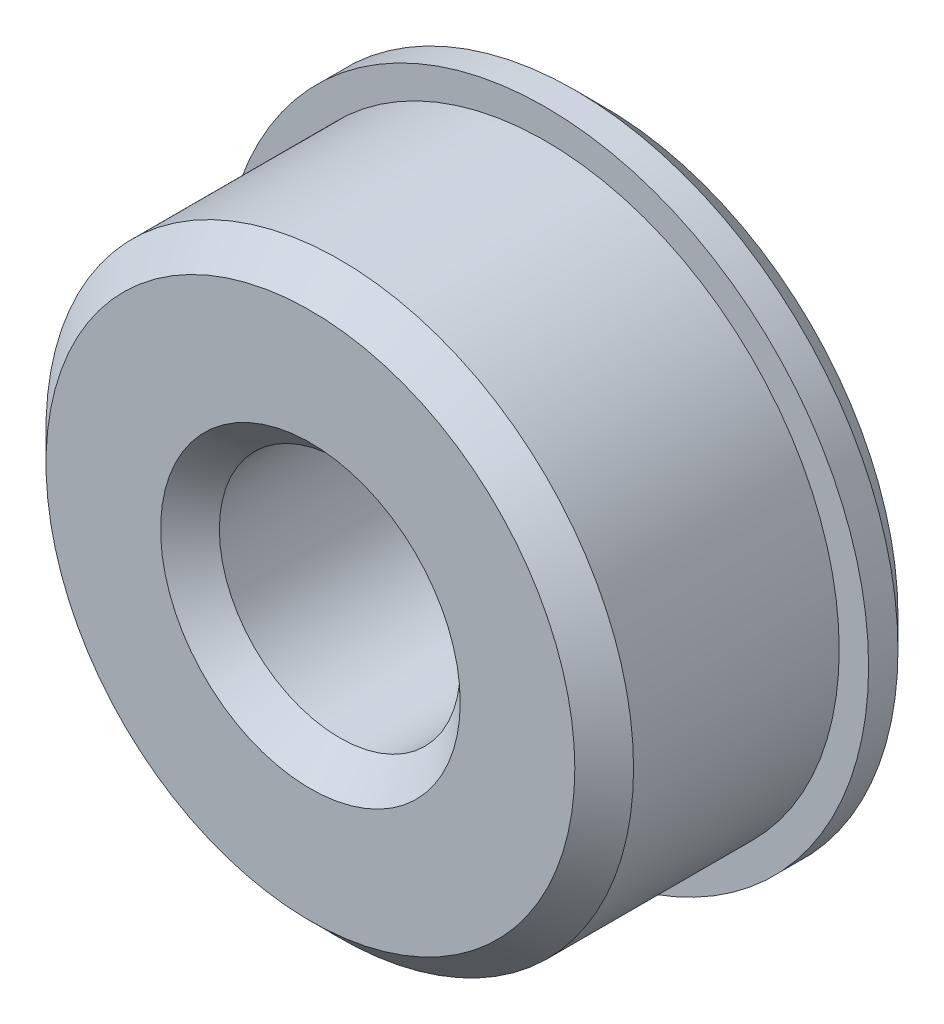
ISO-10303-21;
HEADER;
FILE_DESCRIPTION(('STEP AP214'),'2;1');
FILE_NAME('part.step','',(''),(''),'','','');
FILE_SCHEMA(('AUTOMOTIVE_DESIGN { 1 0 10303 214 1 1 1 1 }'));
ENDSEC;
DATA;
#1=APPLICATION_CONTEXT('core data for automotive mechanical design processes');
#2=APPLICATION_PROTOCOL_DEFINITION('international standard','automotive_design',2000,#1);
#3=PRODUCT_CONTEXT('',#1,'mechanical');
#4=PRODUCT('Part','Part','',(#3));
#5=PRODUCT_RELATED_PRODUCT_CATEGORY('part','',(#4));
#6=PRODUCT_DEFINITION_FORMATION('','',#4);
#7=PRODUCT_DEFINITION_CONTEXT('part definition',#1,'design');
#8=PRODUCT_DEFINITION('design','',#6,#7);
#9=PRODUCT_DEFINITION_SHAPE('','',#8);
#10=(LENGTH_UNIT() NAMED_UNIT(*) SI_UNIT(.MILLI.,.METRE.));
#11=(NAMED_UNIT(*) PLANE_ANGLE_UNIT() SI_UNIT($,.RADIAN.));
#12=(NAMED_UNIT(*) SI_UNIT($,.STERADIAN.) SOLID_ANGLE_UNIT());
#13=UNCERTAINTY_MEASURE_WITH_UNIT(LENGTH_MEASURE(1.E-05),#10,'distance_accuracy_value','');
#14=(GEOMETRIC_REPRESENTATION_CONTEXT(3) GLOBAL_UNCERTAINTY_ASSIGNED_CONTEXT((#13)) GLOBAL_UNIT_ASSIGNED_CONTEXT((#10,
#11,#12)) REPRESENTATION_CONTEXT('',''));
#15=CARTESIAN_POINT('',(0.,0.,0.));
#16=DIRECTION('',(0.,0.,1.));
#17=DIRECTION('',(1.,0.,0.));
#18=AXIS2_PLACEMENT_3D('',#15,#16,#17);
#19=CARTESIAN_POINT('',(0.,0.,4.));
#20=DIRECTION('',(0.,0.,-1.));
#21=DIRECTION('',(-1.,0.,0.));
#22=AXIS2_PLACEMENT_3D('',#19,#20,#21);
#23=CYLINDRICAL_SURFACE('',#22,5.);
#24=CARTESIAN_POINT('',(0.,0.,3.49999999999999));
#25=DIRECTION('',(0.,0.,1.));
#26=DIRECTION('',(1.,0.,0.));
#27=AXIS2_PLACEMENT_3D('',#24,#25,#26);
#28=CIRCLE('',#27,5.);
#29=CARTESIAN_POINT('',(5.,0.,3.49999999999999));
#30=VERTEX_POINT('',#29);
#31=EDGE_CURVE('E63',#30,#30,#28,.F.);
#32=ORIENTED_EDGE('',*,*,#31,.T.);
#33=EDGE_LOOP('',(#32));
#34=FACE_BOUND('',#33,.T.);
#35=CARTESIAN_POINT('',(0.,0.,0.));
#36=DIRECTION('',(0.,0.,1.));
#37=DIRECTION('',(1.,0.,0.));
#38=AXIS2_PLACEMENT_3D('',#35,#36,#37);
#39=CIRCLE('',#38,5.);
#40=CARTESIAN_POINT('',(5.,0.,0.));
#41=VERTEX_POINT('',#40);
#42=EDGE_CURVE('E72',#41,#41,#39,.T.);
#43=ORIENTED_EDGE('',*,*,#42,.T.);
#44=EDGE_LOOP('',(#43));
#45=FACE_BOUND('',#44,.T.);
#46=ADVANCED_FACE('F39',(#34,#45),#23,.T.);
#47=CARTESIAN_POINT('',(0.,0.,4.));
#48=DIRECTION('',(0.,0.,1.));
#49=DIRECTION('',(1.,0.,0.));
#50=AXIS2_PLACEMENT_3D('',#47,#48,#49);
#51=PLANE('',#50);
#52=CARTESIAN_POINT('',(0.,0.,4.));
#53=DIRECTION('',(0.,0.,1.));
#54=DIRECTION('',(1.,0.,0.));
#55=AXIS2_PLACEMENT_3D('',#52,#53,#54);
#56=CIRCLE('',#55,4.49999999999999);
#57=CARTESIAN_POINT('',(4.49999999999999,0.,4.));
#58=VERTEX_POINT('',#57);
#59=EDGE_CURVE('E66',#58,#58,#56,.T.);
#60=ORIENTED_EDGE('',*,*,#59,.T.);
#61=EDGE_LOOP('',(#60));
#62=FACE_BOUND('',#61,.T.);
#63=CARTESIAN_POINT('',(0.,0.,4.));
#64=DIRECTION('',(0.,0.,1.));
#65=DIRECTION('',(1.,0.,0.));
#66=AXIS2_PLACEMENT_3D('',#63,#64,#65);
#67=CIRCLE('',#66,2.55);
#68=CARTESIAN_POINT('',(2.55,0.,4.));
#69=VERTEX_POINT('',#68);
#70=EDGE_CURVE('E69',#69,#69,#67,.F.);
#71=ORIENTED_EDGE('',*,*,#70,.T.);
#72=EDGE_LOOP('',(#71));
#73=FACE_BOUND('',#72,.T.);
#74=ADVANCED_FACE('F84',(#62,#73),#51,.T.);
#75=CARTESIAN_POINT('',(0.,0.,-1.));
#76=DIRECTION('',(0.,0.,1.));
#77=DIRECTION('',(1.,0.,0.));
#78=AXIS2_PLACEMENT_3D('',#75,#76,#77);
#79=CYLINDRICAL_SURFACE('',#78,5.5);
#80=CARTESIAN_POINT('',(0.,0.,-0.499999999999998));
#81=DIRECTION('',(0.,0.,1.));
#82=DIRECTION('',(1.,0.,0.));
#83=AXIS2_PLACEMENT_3D('',#80,#81,#82);
#84=CIRCLE('',#83,5.5);
#85=CARTESIAN_POINT('',(5.5,0.,-0.499999999999998));
#86=VERTEX_POINT('',#85);
#87=EDGE_CURVE('E51',#86,#86,#84,.T.);
#88=ORIENTED_EDGE('',*,*,#87,.T.);
#89=EDGE_LOOP('',(#88));
#90=FACE_BOUND('',#89,.T.);
#91=CARTESIAN_POINT('',(0.,0.,0.));
#92=DIRECTION('',(0.,0.,1.));
#93=DIRECTION('',(1.,0.,0.));
#94=AXIS2_PLACEMENT_3D('',#91,#92,#93);
#95=CIRCLE('',#94,5.5);
#96=CARTESIAN_POINT('',(5.5,0.,0.));
#97=VERTEX_POINT('',#96);
#98=EDGE_CURVE('E75',#97,#97,#95,.T.);
#99=ORIENTED_EDGE('',*,*,#98,.F.);
#100=EDGE_LOOP('',(#99));
#101=FACE_BOUND('',#100,.T.);
#102=ADVANCED_FACE('F81',(#90,#101),#79,.T.);
#103=CARTESIAN_POINT('',(0.,0.,-1.));
#104=DIRECTION('',(0.,0.,1.));
#105=DIRECTION('',(1.,0.,0.));
#106=AXIS2_PLACEMENT_3D('',#103,#104,#105);
#107=PLANE('',#106);
#108=CARTESIAN_POINT('',(0.,0.,-1.));
#109=DIRECTION('',(0.,0.,1.));
#110=DIRECTION('',(1.,0.,0.));
#111=AXIS2_PLACEMENT_3D('',#108,#109,#110);
#112=CIRCLE('',#111,5.);
#113=CARTESIAN_POINT('',(5.,0.,-1.));
#114=VERTEX_POINT('',#113);
#115=EDGE_CURVE('E10',#114,#114,#112,.F.);
#116=ORIENTED_EDGE('',*,*,#115,.T.);
#117=EDGE_LOOP('',(#116));
#118=FACE_BOUND('',#117,.T.);
#119=CARTESIAN_POINT('',(0.,0.,-1.));
#120=DIRECTION('',(0.,0.,1.));
#121=DIRECTION('',(1.,0.,0.));
#122=AXIS2_PLACEMENT_3D('',#119,#120,#121);
#123=CIRCLE('',#122,2.55);
#124=CARTESIAN_POINT('',(2.55,0.,-1.));
#125=VERTEX_POINT('',#124);
#126=EDGE_CURVE('E47',#125,#125,#123,.T.);
#127=ORIENTED_EDGE('',*,*,#126,.T.);
#128=EDGE_LOOP('',(#127));
#129=FACE_BOUND('',#128,.T.);
#130=ADVANCED_FACE('F83',(#118,#129),#107,.F.);
#131=CARTESIAN_POINT('',(0.,0.,0.));
#132=DIRECTION('',(0.,0.,1.));
#133=DIRECTION('',(1.,0.,0.));
#134=AXIS2_PLACEMENT_3D('',#131,#132,#133);
#135=PLANE('',#134);
#136=ORIENTED_EDGE('',*,*,#42,.F.);
#137=EDGE_LOOP('',(#136));
#138=FACE_BOUND('',#137,.T.);
#139=ORIENTED_EDGE('',*,*,#98,.T.);
#140=EDGE_LOOP('',(#139));
#141=FACE_BOUND('',#140,.T.);
#142=ADVANCED_FACE('F79',(#138,#141),#135,.T.);
#143=CARTESIAN_POINT('',(0.,0.,-1.));
#144=DIRECTION('',(0.,0.,1.));
#145=DIRECTION('',(1.,0.,0.));
#146=AXIS2_PLACEMENT_3D('',#143,#144,#145);
#147=CYLINDRICAL_SURFACE('',#146,2.05);
#148=CARTESIAN_POINT('',(0.,0.,3.5));
#149=DIRECTION('',(0.,0.,1.));
#150=DIRECTION('',(1.,0.,0.));
#151=AXIS2_PLACEMENT_3D('',#148,#149,#150);
#152=CIRCLE('',#151,2.05);
#153=CARTESIAN_POINT('',(2.05,0.,3.5));
#154=VERTEX_POINT('',#153);
#155=EDGE_CURVE('E55',#154,#154,#152,.T.);
#156=ORIENTED_EDGE('',*,*,#155,.T.);
#157=EDGE_LOOP('',(#156));
#158=FACE_BOUND('',#157,.T.);
#159=CARTESIAN_POINT('',(0.,0.,-0.5));
#160=DIRECTION('',(0.,0.,1.));
#161=DIRECTION('',(1.,0.,0.));
#162=AXIS2_PLACEMENT_3D('',#159,#160,#161);
#163=CIRCLE('',#162,2.05);
#164=CARTESIAN_POINT('',(2.05,0.,-0.5));
#165=VERTEX_POINT('',#164);
#166=EDGE_CURVE('E60',#165,#165,#163,.F.);
#167=ORIENTED_EDGE('',*,*,#166,.T.);
#168=EDGE_LOOP('',(#167));
#169=FACE_BOUND('',#168,.T.);
#170=ADVANCED_FACE('F111',(#158,#169),#147,.F.);
#171=CARTESIAN_POINT('',(0.,0.,4.));
#172=DIRECTION('',(0.,0.,-1.));
#173=DIRECTION('',(-1.,0.,0.));
#174=AXIS2_PLACEMENT_3D('',#171,#172,#173);
#175=CONICAL_SURFACE('',#174,4.49999999999999,0.785398163397445);
#176=ORIENTED_EDGE('',*,*,#31,.F.);
#177=EDGE_LOOP('',(#176));
#178=FACE_BOUND('',#177,.T.);
#179=ORIENTED_EDGE('',*,*,#59,.F.);
#180=EDGE_LOOP('',(#179));
#181=FACE_BOUND('',#180,.T.);
#182=ADVANCED_FACE('F104',(#178,#181),#175,.T.);
#183=CARTESIAN_POINT('',(0.,0.,3.5));
#184=DIRECTION('',(0.,0.,1.));
#185=DIRECTION('',(1.,0.,0.));
#186=AXIS2_PLACEMENT_3D('',#183,#184,#185);
#187=CONICAL_SURFACE('',#186,2.05,0.78539816339745);
#188=ORIENTED_EDGE('',*,*,#70,.F.);
#189=EDGE_LOOP('',(#188));
#190=FACE_BOUND('',#189,.T.);
#191=ORIENTED_EDGE('',*,*,#155,.F.);
#192=EDGE_LOOP('',(#191));
#193=FACE_BOUND('',#192,.T.);
#194=ADVANCED_FACE('F110',(#190,#193),#187,.F.);
#195=CARTESIAN_POINT('',(0.,0.,-0.499999999999998));
#196=DIRECTION('',(0.,0.,1.));
#197=DIRECTION('',(1.,0.,0.));
#198=AXIS2_PLACEMENT_3D('',#195,#196,#197);
#199=CONICAL_SURFACE('',#198,5.5,0.78539816339745);
#200=ORIENTED_EDGE('',*,*,#115,.F.);
#201=EDGE_LOOP('',(#200));
#202=FACE_BOUND('',#201,.T.);
#203=ORIENTED_EDGE('',*,*,#87,.F.);
#204=EDGE_LOOP('',(#203));
#205=FACE_BOUND('',#204,.T.);
#206=ADVANCED_FACE('F117',(#202,#205),#199,.T.);
#207=CARTESIAN_POINT('',(0.,0.,-1.));
#208=DIRECTION('',(0.,0.,-1.));
#209=DIRECTION('',(-1.,0.,0.));
#210=AXIS2_PLACEMENT_3D('',#207,#208,#209);
#211=CONICAL_SURFACE('',#210,2.55,0.785398163397445);
#212=ORIENTED_EDGE('',*,*,#166,.F.);
#213=EDGE_LOOP('',(#212));
#214=FACE_BOUND('',#213,.T.);
#215=ORIENTED_EDGE('',*,*,#126,.F.);
#216=EDGE_LOOP('',(#215));
#217=FACE_BOUND('',#216,.T.);
#218=ADVANCED_FACE('F42',(#214,#217),#211,.F.);
#219=CLOSED_SHELL('',(#46,#74,#102,#130,#142,#170,#182,#194,#206,#218));
#220=MANIFOLD_SOLID_BREP('B2',#219);
#221=ADVANCED_BREP_SHAPE_REPRESENTATION('',(#18,#220),#14);
#222=SHAPE_DEFINITION_REPRESENTATION(#9,#221);
ENDSEC;
END-ISO-10303-21;
